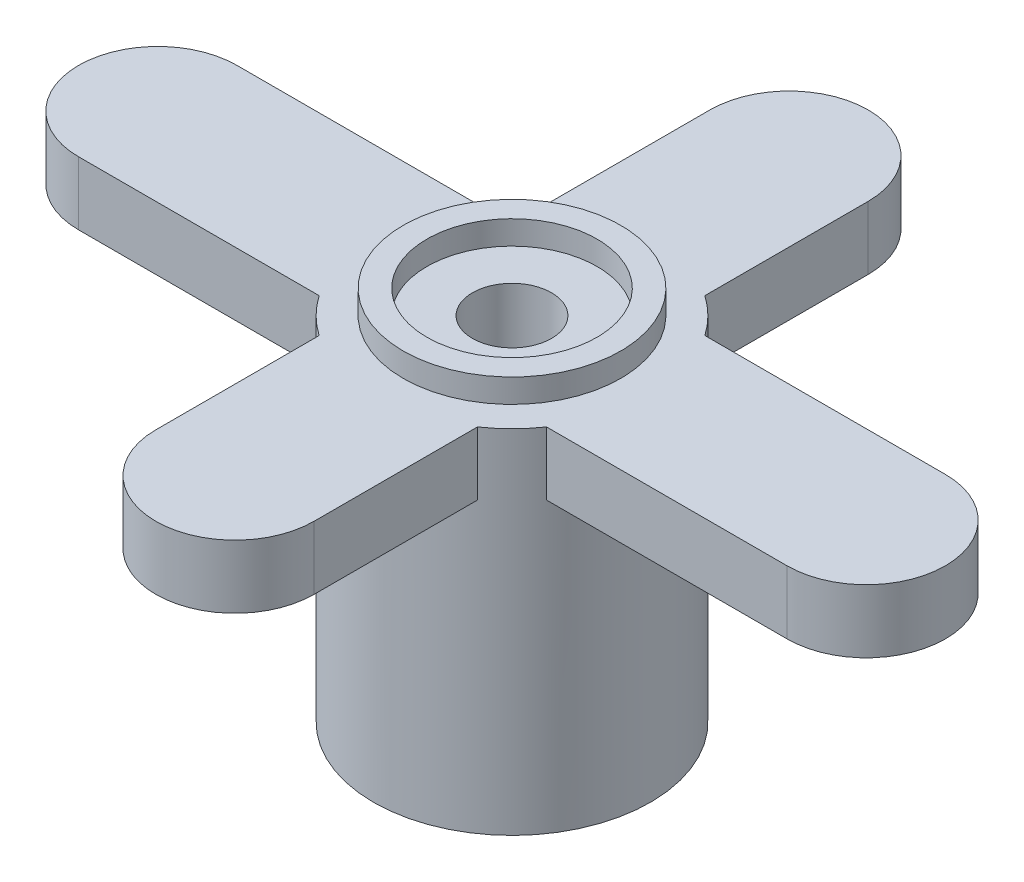
ISO-10303-21;
HEADER;
FILE_DESCRIPTION(('STEP AP214'),'2;1');
FILE_NAME('part.step','',(''),(''),'','','');
FILE_SCHEMA(('AUTOMOTIVE_DESIGN { 1 0 10303 214 1 1 1 1 }'));
ENDSEC;
DATA;
#1=APPLICATION_CONTEXT('core data for automotive mechanical design processes');
#2=APPLICATION_PROTOCOL_DEFINITION('international standard','automotive_design',2000,#1);
#3=PRODUCT_CONTEXT('',#1,'mechanical');
#4=PRODUCT('Part','Part','',(#3));
#5=PRODUCT_RELATED_PRODUCT_CATEGORY('part','',(#4));
#6=PRODUCT_DEFINITION_FORMATION('','',#4);
#7=PRODUCT_DEFINITION_CONTEXT('part definition',#1,'design');
#8=PRODUCT_DEFINITION('design','',#6,#7);
#9=PRODUCT_DEFINITION_SHAPE('','',#8);
#10=(LENGTH_UNIT() NAMED_UNIT(*) SI_UNIT(.MILLI.,.METRE.));
#11=(NAMED_UNIT(*) PLANE_ANGLE_UNIT() SI_UNIT($,.RADIAN.));
#12=(NAMED_UNIT(*) SI_UNIT($,.STERADIAN.) SOLID_ANGLE_UNIT());
#13=UNCERTAINTY_MEASURE_WITH_UNIT(LENGTH_MEASURE(1.E-05),#10,'distance_accuracy_value','');
#14=(GEOMETRIC_REPRESENTATION_CONTEXT(3) GLOBAL_UNCERTAINTY_ASSIGNED_CONTEXT((#13)) GLOBAL_UNIT_ASSIGNED_CONTEXT((#10,
#11,#12)) REPRESENTATION_CONTEXT('',''));
#15=CARTESIAN_POINT('',(0.,0.,0.));
#16=DIRECTION('',(0.,0.,1.));
#17=DIRECTION('',(1.,0.,0.));
#18=AXIS2_PLACEMENT_3D('',#15,#16,#17);
#19=CARTESIAN_POINT('',(0.,9.5,0.));
#20=DIRECTION('',(0.,-1.,0.));
#21=DIRECTION('',(0.,0.,-1.));
#22=AXIS2_PLACEMENT_3D('',#19,#20,#21);
#23=CYLINDRICAL_SURFACE('',#22,3.5);
#24=CARTESIAN_POINT('',(0.,0.,0.));
#25=DIRECTION('',(0.,1.,0.));
#26=DIRECTION('',(0.,0.,1.));
#27=AXIS2_PLACEMENT_3D('',#24,#25,#26);
#28=CIRCLE('',#27,3.5);
#29=CARTESIAN_POINT('',(0.,0.,3.5));
#30=VERTEX_POINT('',#29);
#31=EDGE_CURVE('E171',#30,#30,#28,.T.);
#32=ORIENTED_EDGE('',*,*,#31,.T.);
#33=EDGE_LOOP('',(#32));
#34=FACE_BOUND('',#33,.T.);
#35=CARTESIAN_POINT('',(0.,8.9,0.));
#36=DIRECTION('',(0.,1.,0.));
#37=DIRECTION('',(0.,0.,1.));
#38=AXIS2_PLACEMENT_3D('',#35,#36,#37);
#39=CIRCLE('',#38,3.5);
#40=CARTESIAN_POINT('',(2.87228132326901,8.9,2.));
#41=VERTEX_POINT('',#40);
#42=CARTESIAN_POINT('',(2.,8.9,2.87228132326901));
#43=VERTEX_POINT('',#42);
#44=EDGE_CURVE('E157',#41,#43,#39,.F.);
#45=ORIENTED_EDGE('',*,*,#44,.T.);
#46=DIRECTION('',(0.,-1.,0.));
#47=VECTOR('',#46,1.);
#48=CARTESIAN_POINT('',(2.,9.5,2.87228132326901));
#49=LINE('',#48,#47);
#50=CARTESIAN_POINT('',(2.,7.3,2.87228132326901));
#51=VERTEX_POINT('',#50);
#52=EDGE_CURVE('E196',#43,#51,#49,.T.);
#53=ORIENTED_EDGE('',*,*,#52,.T.);
#54=CARTESIAN_POINT('',(0.,7.3,0.));
#55=DIRECTION('',(0.,1.,0.));
#56=DIRECTION('',(0.,0.,1.));
#57=AXIS2_PLACEMENT_3D('',#54,#55,#56);
#58=CIRCLE('',#57,3.5);
#59=CARTESIAN_POINT('',(-2.,7.3,2.87228132326901));
#60=VERTEX_POINT('',#59);
#61=EDGE_CURVE('E11',#60,#51,#58,.T.);
#62=ORIENTED_EDGE('',*,*,#61,.F.);
#63=DIRECTION('',(0.,-1.,0.));
#64=VECTOR('',#63,1.);
#65=CARTESIAN_POINT('',(-2.,9.5,2.87228132326901));
#66=LINE('',#65,#64);
#67=CARTESIAN_POINT('',(-2.,8.9,2.87228132326901));
#68=VERTEX_POINT('',#67);
#69=EDGE_CURVE('E39',#68,#60,#66,.T.);
#70=ORIENTED_EDGE('',*,*,#69,.F.);
#71=CARTESIAN_POINT('',(-2.87228132326901,8.9,2.));
#72=VERTEX_POINT('',#71);
#73=EDGE_CURVE('E146',#68,#72,#39,.F.);
#74=ORIENTED_EDGE('',*,*,#73,.T.);
#75=DIRECTION('',(0.,-1.,0.));
#76=VECTOR('',#75,1.);
#77=CARTESIAN_POINT('',(-2.87228132326901,9.5,2.));
#78=LINE('',#77,#76);
#79=CARTESIAN_POINT('',(-2.87228132326901,7.3,2.));
#80=VERTEX_POINT('',#79);
#81=EDGE_CURVE('E149',#72,#80,#78,.T.);
#82=ORIENTED_EDGE('',*,*,#81,.T.);
#83=CARTESIAN_POINT('',(0.,7.3,0.));
#84=DIRECTION('',(0.,1.,0.));
#85=DIRECTION('',(0.,0.,1.));
#86=AXIS2_PLACEMENT_3D('',#83,#84,#85);
#87=CIRCLE('',#86,3.5);
#88=CARTESIAN_POINT('',(-2.87228132326901,7.3,-2.));
#89=VERTEX_POINT('',#88);
#90=EDGE_CURVE('E46',#89,#80,#87,.T.);
#91=ORIENTED_EDGE('',*,*,#90,.F.);
#92=DIRECTION('',(0.,-1.,0.));
#93=VECTOR('',#92,1.);
#94=CARTESIAN_POINT('',(-2.87228132326901,9.5,-2.));
#95=LINE('',#94,#93);
#96=CARTESIAN_POINT('',(-2.87228132326901,8.9,-2.));
#97=VERTEX_POINT('',#96);
#98=EDGE_CURVE('E54',#97,#89,#95,.T.);
#99=ORIENTED_EDGE('',*,*,#98,.F.);
#100=CARTESIAN_POINT('',(-2.,8.9,-2.87228132326901));
#101=VERTEX_POINT('',#100);
#102=EDGE_CURVE('E155',#97,#101,#39,.F.);
#103=ORIENTED_EDGE('',*,*,#102,.T.);
#104=DIRECTION('',(0.,-1.,0.));
#105=VECTOR('',#104,1.);
#106=CARTESIAN_POINT('',(-2.,9.5,-2.87228132326901));
#107=LINE('',#106,#105);
#108=CARTESIAN_POINT('',(-2.,7.3,-2.87228132326901));
#109=VERTEX_POINT('',#108);
#110=EDGE_CURVE('E180',#109,#101,#107,.F.);
#111=ORIENTED_EDGE('',*,*,#110,.F.);
#112=CARTESIAN_POINT('',(0.,7.3,0.));
#113=DIRECTION('',(0.,1.,0.));
#114=DIRECTION('',(0.,0.,1.));
#115=AXIS2_PLACEMENT_3D('',#112,#113,#114);
#116=CIRCLE('',#115,3.5);
#117=CARTESIAN_POINT('',(2.,7.3,-2.87228132326901));
#118=VERTEX_POINT('',#117);
#119=EDGE_CURVE('E186',#118,#109,#116,.T.);
#120=ORIENTED_EDGE('',*,*,#119,.F.);
#121=DIRECTION('',(0.,-1.,0.));
#122=VECTOR('',#121,1.);
#123=CARTESIAN_POINT('',(2.,9.5,-2.87228132326901));
#124=LINE('',#123,#122);
#125=CARTESIAN_POINT('',(2.,8.9,-2.87228132326901));
#126=VERTEX_POINT('',#125);
#127=EDGE_CURVE('E183',#118,#126,#124,.F.);
#128=ORIENTED_EDGE('',*,*,#127,.T.);
#129=CARTESIAN_POINT('',(2.87228132326901,8.9,-2.));
#130=VERTEX_POINT('',#129);
#131=EDGE_CURVE('E395',#126,#130,#39,.F.);
#132=ORIENTED_EDGE('',*,*,#131,.T.);
#133=DIRECTION('',(0.,-1.,0.));
#134=VECTOR('',#133,1.);
#135=CARTESIAN_POINT('',(2.87228132326901,9.5,-2.));
#136=LINE('',#135,#134);
#137=CARTESIAN_POINT('',(2.87228132326901,7.3,-2.));
#138=VERTEX_POINT('',#137);
#139=EDGE_CURVE('E188',#138,#130,#136,.F.);
#140=ORIENTED_EDGE('',*,*,#139,.F.);
#141=CARTESIAN_POINT('',(0.,7.3,0.));
#142=DIRECTION('',(0.,1.,0.));
#143=DIRECTION('',(0.,0.,1.));
#144=AXIS2_PLACEMENT_3D('',#141,#142,#143);
#145=CIRCLE('',#144,3.5);
#146=CARTESIAN_POINT('',(2.87228132326901,7.3,2.));
#147=VERTEX_POINT('',#146);
#148=EDGE_CURVE('E194',#147,#138,#145,.T.);
#149=ORIENTED_EDGE('',*,*,#148,.F.);
#150=DIRECTION('',(0.,-1.,0.));
#151=VECTOR('',#150,1.);
#152=CARTESIAN_POINT('',(2.87228132326901,9.5,2.));
#153=LINE('',#152,#151);
#154=EDGE_CURVE('E191',#147,#41,#153,.F.);
#155=ORIENTED_EDGE('',*,*,#154,.T.);
#156=EDGE_LOOP('',(#45,#53,#62,#70,#74,#82,#91,#99,#103,#111,#120,#128,#132,#140,#149,#155));
#157=FACE_BOUND('',#156,.T.);
#158=ADVANCED_FACE('F32',(#34,#157),#23,.T.);
#159=CARTESIAN_POINT('',(0.,9.5,0.));
#160=DIRECTION('',(0.,1.,0.));
#161=DIRECTION('',(0.,0.,1.));
#162=AXIS2_PLACEMENT_3D('',#159,#160,#161);
#163=PLANE('',#162);
#164=CARTESIAN_POINT('',(0.,9.5,0.));
#165=DIRECTION('',(0.,1.,0.));
#166=DIRECTION('',(0.,0.,1.));
#167=AXIS2_PLACEMENT_3D('',#164,#165,#166);
#168=CIRCLE('',#167,2.15);
#169=CARTESIAN_POINT('',(0.,9.5,2.15));
#170=VERTEX_POINT('',#169);
#171=EDGE_CURVE('E404',#170,#170,#168,.T.);
#172=ORIENTED_EDGE('',*,*,#171,.F.);
#173=EDGE_LOOP('',(#172));
#174=FACE_BOUND('',#173,.T.);
#175=CARTESIAN_POINT('',(0.,9.5,0.));
#176=DIRECTION('',(0.,1.,0.));
#177=DIRECTION('',(0.,0.,1.));
#178=AXIS2_PLACEMENT_3D('',#175,#176,#177);
#179=CIRCLE('',#178,2.75);
#180=CARTESIAN_POINT('',(0.,9.5,2.75));
#181=VERTEX_POINT('',#180);
#182=EDGE_CURVE('E393',#181,#181,#179,.T.);
#183=ORIENTED_EDGE('',*,*,#182,.T.);
#184=EDGE_LOOP('',(#183));
#185=FACE_BOUND('',#184,.T.);
#186=ADVANCED_FACE('F294',(#174,#185),#163,.T.);
#187=CARTESIAN_POINT('',(0.,0.,0.));
#188=DIRECTION('',(0.,1.,0.));
#189=DIRECTION('',(0.,0.,1.));
#190=AXIS2_PLACEMENT_3D('',#187,#188,#189);
#191=PLANE('',#190);
#192=CARTESIAN_POINT('',(0.,0.,0.));
#193=DIRECTION('',(0.,-1.,0.));
#194=DIRECTION('',(0.,0.,-1.));
#195=AXIS2_PLACEMENT_3D('',#192,#193,#194);
#196=CIRCLE('',#195,1.9);
#197=CARTESIAN_POINT('',(0.,0.,-1.9));
#198=VERTEX_POINT('',#197);
#199=EDGE_CURVE('E283',#198,#198,#196,.T.);
#200=ORIENTED_EDGE('',*,*,#199,.F.);
#201=EDGE_LOOP('',(#200));
#202=FACE_BOUND('',#201,.T.);
#203=ORIENTED_EDGE('',*,*,#31,.F.);
#204=EDGE_LOOP('',(#203));
#205=FACE_BOUND('',#204,.T.);
#206=ADVANCED_FACE('F291',(#202,#205),#191,.F.);
#207=CARTESIAN_POINT('',(0.,3.5,0.));
#208=DIRECTION('',(0.,-1.,0.));
#209=DIRECTION('',(0.,0.,-1.));
#210=AXIS2_PLACEMENT_3D('',#207,#208,#209);
#211=CYLINDRICAL_SURFACE('',#210,1.9);
#212=CARTESIAN_POINT('',(0.,3.5,0.));
#213=DIRECTION('',(0.,-1.,0.));
#214=DIRECTION('',(0.,0.,-1.));
#215=AXIS2_PLACEMENT_3D('',#212,#213,#214);
#216=CIRCLE('',#215,1.9);
#217=CARTESIAN_POINT('',(0.,3.5,-1.9));
#218=VERTEX_POINT('',#217);
#219=EDGE_CURVE('E175',#218,#218,#216,.T.);
#220=ORIENTED_EDGE('',*,*,#219,.F.);
#221=EDGE_LOOP('',(#220));
#222=FACE_BOUND('',#221,.T.);
#223=ORIENTED_EDGE('',*,*,#199,.T.);
#224=EDGE_LOOP('',(#223));
#225=FACE_BOUND('',#224,.T.);
#226=ADVANCED_FACE('F289',(#222,#225),#211,.F.);
#227=CARTESIAN_POINT('',(0.,3.5,0.));
#228=DIRECTION('',(0.,-1.,0.));
#229=DIRECTION('',(0.,0.,-1.));
#230=AXIS2_PLACEMENT_3D('',#227,#228,#229);
#231=PLANE('',#230);
#232=CARTESIAN_POINT('',(0.,3.5,0.));
#233=DIRECTION('',(0.,-1.,0.));
#234=DIRECTION('',(0.,0.,-1.));
#235=AXIS2_PLACEMENT_3D('',#232,#233,#234);
#236=CIRCLE('',#235,1.);
#237=CARTESIAN_POINT('',(0.,3.5,-1.));
#238=VERTEX_POINT('',#237);
#239=EDGE_CURVE('E401',#238,#238,#236,.T.);
#240=ORIENTED_EDGE('',*,*,#239,.F.);
#241=EDGE_LOOP('',(#240));
#242=FACE_BOUND('',#241,.T.);
#243=ORIENTED_EDGE('',*,*,#219,.T.);
#244=EDGE_LOOP('',(#243));
#245=FACE_BOUND('',#244,.T.);
#246=ADVANCED_FACE('F310',(#242,#245),#231,.T.);
#247=CARTESIAN_POINT('',(0.,7.3,-2.));
#248=DIRECTION('',(0.,0.,1.));
#249=DIRECTION('',(1.,0.,0.));
#250=AXIS2_PLACEMENT_3D('',#247,#248,#249);
#251=PLANE('',#250);
#252=DIRECTION('',(1.,0.,0.));
#253=VECTOR('',#252,1.);
#254=CARTESIAN_POINT('',(0.,8.9,-2.));
#255=LINE('',#254,#253);
#256=CARTESIAN_POINT('',(-8.95,8.9,-2.));
#257=VERTEX_POINT('',#256);
#258=EDGE_CURVE('E167',#257,#97,#255,.T.);
#259=ORIENTED_EDGE('',*,*,#258,.T.);
#260=ORIENTED_EDGE('',*,*,#98,.T.);
#261=DIRECTION('',(1.,0.,0.));
#262=VECTOR('',#261,1.);
#263=CARTESIAN_POINT('',(0.,7.3,-2.));
#264=LINE('',#263,#262);
#265=CARTESIAN_POINT('',(-8.95,7.3,-2.));
#266=VERTEX_POINT('',#265);
#267=EDGE_CURVE('E276',#266,#89,#264,.T.);
#268=ORIENTED_EDGE('',*,*,#267,.F.);
#269=DIRECTION('',(0.,1.,0.));
#270=VECTOR('',#269,1.);
#271=CARTESIAN_POINT('',(-8.95,7.3,-2.));
#272=LINE('',#271,#270);
#273=EDGE_CURVE('E281',#266,#257,#272,.T.);
#274=ORIENTED_EDGE('',*,*,#273,.T.);
#275=EDGE_LOOP('',(#259,#260,#268,#274));
#276=FACE_BOUND('',#275,.T.);
#277=ADVANCED_FACE('F314',(#276),#251,.F.);
#278=CARTESIAN_POINT('',(0.,7.3,2.));
#279=DIRECTION('',(0.,0.,1.));
#280=DIRECTION('',(1.,0.,0.));
#281=AXIS2_PLACEMENT_3D('',#278,#279,#280);
#282=PLANE('',#281);
#283=ORIENTED_EDGE('',*,*,#81,.F.);
#284=DIRECTION('',(1.,0.,0.));
#285=VECTOR('',#284,1.);
#286=CARTESIAN_POINT('',(0.,8.9,2.));
#287=LINE('',#286,#285);
#288=CARTESIAN_POINT('',(-8.95,8.9,2.));
#289=VERTEX_POINT('',#288);
#290=EDGE_CURVE('E160',#289,#72,#287,.T.);
#291=ORIENTED_EDGE('',*,*,#290,.F.);
#292=DIRECTION('',(0.,1.,0.));
#293=VECTOR('',#292,1.);
#294=CARTESIAN_POINT('',(-8.95,7.3,2.));
#295=LINE('',#294,#293);
#296=CARTESIAN_POINT('',(-8.95,7.3,2.));
#297=VERTEX_POINT('',#296);
#298=EDGE_CURVE('E278',#297,#289,#295,.T.);
#299=ORIENTED_EDGE('',*,*,#298,.F.);
#300=DIRECTION('',(1.,0.,0.));
#301=VECTOR('',#300,1.);
#302=CARTESIAN_POINT('',(0.,7.3,2.));
#303=LINE('',#302,#301);
#304=EDGE_CURVE('E170',#297,#80,#303,.T.);
#305=ORIENTED_EDGE('',*,*,#304,.T.);
#306=EDGE_LOOP('',(#283,#291,#299,#305));
#307=FACE_BOUND('',#306,.T.);
#308=ADVANCED_FACE('F169',(#307),#282,.T.);
#309=CARTESIAN_POINT('',(-8.95,7.3,0.));
#310=DIRECTION('',(0.,1.,0.));
#311=DIRECTION('',(0.,0.,1.));
#312=AXIS2_PLACEMENT_3D('',#309,#310,#311);
#313=CYLINDRICAL_SURFACE('',#312,2.);
#314=CARTESIAN_POINT('',(-8.95,8.9,0.));
#315=DIRECTION('',(0.,1.,0.));
#316=DIRECTION('',(0.,0.,1.));
#317=AXIS2_PLACEMENT_3D('',#314,#315,#316);
#318=CIRCLE('',#317,2.);
#319=EDGE_CURVE('E165',#257,#289,#318,.T.);
#320=ORIENTED_EDGE('',*,*,#319,.F.);
#321=ORIENTED_EDGE('',*,*,#273,.F.);
#322=CARTESIAN_POINT('',(-8.95,7.3,0.));
#323=DIRECTION('',(0.,1.,0.));
#324=DIRECTION('',(0.,0.,1.));
#325=AXIS2_PLACEMENT_3D('',#322,#323,#324);
#326=CIRCLE('',#325,2.);
#327=EDGE_CURVE('E272',#266,#297,#326,.T.);
#328=ORIENTED_EDGE('',*,*,#327,.T.);
#329=ORIENTED_EDGE('',*,*,#298,.T.);
#330=EDGE_LOOP('',(#320,#321,#328,#329));
#331=FACE_BOUND('',#330,.T.);
#332=ADVANCED_FACE('F316',(#331),#313,.T.);
#333=CARTESIAN_POINT('',(0.,7.3,0.));
#334=DIRECTION('',(0.,1.,0.));
#335=DIRECTION('',(0.,0.,1.));
#336=AXIS2_PLACEMENT_3D('',#333,#334,#335);
#337=PLANE('',#336);
#338=ORIENTED_EDGE('',*,*,#267,.T.);
#339=ORIENTED_EDGE('',*,*,#90,.T.);
#340=ORIENTED_EDGE('',*,*,#304,.F.);
#341=ORIENTED_EDGE('',*,*,#327,.F.);
#342=EDGE_LOOP('',(#338,#339,#340,#341));
#343=FACE_BOUND('',#342,.T.);
#344=ADVANCED_FACE('F319',(#343),#337,.F.);
#345=CARTESIAN_POINT('',(0.,8.9,0.));
#346=DIRECTION('',(0.,1.,0.));
#347=DIRECTION('',(0.,0.,1.));
#348=AXIS2_PLACEMENT_3D('',#345,#346,#347);
#349=PLANE('',#348);
#350=ORIENTED_EDGE('',*,*,#290,.T.);
#351=ORIENTED_EDGE('',*,*,#73,.F.);
#352=DIRECTION('',(0.,0.,-1.));
#353=VECTOR('',#352,1.);
#354=CARTESIAN_POINT('',(-2.,8.9,0.));
#355=LINE('',#354,#353);
#356=CARTESIAN_POINT('',(-2.,8.9,7.));
#357=VERTEX_POINT('',#356);
#358=EDGE_CURVE('E204',#357,#68,#355,.T.);
#359=ORIENTED_EDGE('',*,*,#358,.F.);
#360=CARTESIAN_POINT('',(0.,8.9,7.));
#361=DIRECTION('',(0.,1.,0.));
#362=DIRECTION('',(0.,0.,1.));
#363=AXIS2_PLACEMENT_3D('',#360,#361,#362);
#364=CIRCLE('',#363,2.);
#365=CARTESIAN_POINT('',(2.,8.9,7.));
#366=VERTEX_POINT('',#365);
#367=EDGE_CURVE('E211',#357,#366,#364,.T.);
#368=ORIENTED_EDGE('',*,*,#367,.T.);
#369=DIRECTION('',(0.,0.,-1.));
#370=VECTOR('',#369,1.);
#371=CARTESIAN_POINT('',(2.,8.9,0.));
#372=LINE('',#371,#370);
#373=EDGE_CURVE('E219',#366,#43,#372,.T.);
#374=ORIENTED_EDGE('',*,*,#373,.T.);
#375=ORIENTED_EDGE('',*,*,#44,.F.);
#376=DIRECTION('',(1.,0.,0.));
#377=VECTOR('',#376,1.);
#378=CARTESIAN_POINT('',(0.,8.9,2.));
#379=LINE('',#378,#377);
#380=CARTESIAN_POINT('',(8.95,8.9,2.));
#381=VERTEX_POINT('',#380);
#382=EDGE_CURVE('E247',#41,#381,#379,.T.);
#383=ORIENTED_EDGE('',*,*,#382,.T.);
#384=CARTESIAN_POINT('',(8.95,8.9,0.));
#385=DIRECTION('',(0.,1.,0.));
#386=DIRECTION('',(0.,0.,1.));
#387=AXIS2_PLACEMENT_3D('',#384,#385,#386);
#388=CIRCLE('',#387,2.);
#389=CARTESIAN_POINT('',(8.95,8.9,-2.));
#390=VERTEX_POINT('',#389);
#391=EDGE_CURVE('E243',#381,#390,#388,.T.);
#392=ORIENTED_EDGE('',*,*,#391,.T.);
#393=DIRECTION('',(1.,0.,0.));
#394=VECTOR('',#393,1.);
#395=CARTESIAN_POINT('',(0.,8.9,-2.));
#396=LINE('',#395,#394);
#397=EDGE_CURVE('E236',#130,#390,#396,.T.);
#398=ORIENTED_EDGE('',*,*,#397,.F.);
#399=ORIENTED_EDGE('',*,*,#131,.F.);
#400=DIRECTION('',(0.,0.,-1.));
#401=VECTOR('',#400,1.);
#402=CARTESIAN_POINT('',(2.,8.9,0.));
#403=LINE('',#402,#401);
#404=CARTESIAN_POINT('',(2.,8.9,-7.));
#405=VERTEX_POINT('',#404);
#406=EDGE_CURVE('E266',#126,#405,#403,.T.);
#407=ORIENTED_EDGE('',*,*,#406,.T.);
#408=CARTESIAN_POINT('',(0.,8.9,-7.));
#409=DIRECTION('',(0.,1.,0.));
#410=DIRECTION('',(0.,0.,1.));
#411=AXIS2_PLACEMENT_3D('',#408,#409,#410);
#412=CIRCLE('',#411,2.);
#413=CARTESIAN_POINT('',(-2.,8.9,-7.));
#414=VERTEX_POINT('',#413);
#415=EDGE_CURVE('E263',#405,#414,#412,.T.);
#416=ORIENTED_EDGE('',*,*,#415,.T.);
#417=DIRECTION('',(0.,0.,-1.));
#418=VECTOR('',#417,1.);
#419=CARTESIAN_POINT('',(-2.,8.9,0.));
#420=LINE('',#419,#418);
#421=EDGE_CURVE('E256',#101,#414,#420,.T.);
#422=ORIENTED_EDGE('',*,*,#421,.F.);
#423=ORIENTED_EDGE('',*,*,#102,.F.);
#424=ORIENTED_EDGE('',*,*,#258,.F.);
#425=ORIENTED_EDGE('',*,*,#319,.T.);
#426=EDGE_LOOP('',(#350,#351,#359,#368,#374,#375,#383,#392,#398,#399,#407,#416,#422,#423,#424,#425));
#427=FACE_BOUND('',#426,.T.);
#428=CARTESIAN_POINT('',(0.,8.9,0.));
#429=DIRECTION('',(0.,1.,0.));
#430=DIRECTION('',(0.,0.,1.));
#431=AXIS2_PLACEMENT_3D('',#428,#429,#430);
#432=CIRCLE('',#431,2.75);
#433=CARTESIAN_POINT('',(0.,8.9,2.75));
#434=VERTEX_POINT('',#433);
#435=EDGE_CURVE('E154',#434,#434,#432,.F.);
#436=ORIENTED_EDGE('',*,*,#435,.T.);
#437=EDGE_LOOP('',(#436));
#438=FACE_BOUND('',#437,.T.);
#439=ADVANCED_FACE('F161',(#427,#438),#349,.T.);
#440=CARTESIAN_POINT('',(2.,7.3,0.));
#441=DIRECTION('',(1.,0.,0.));
#442=DIRECTION('',(0.,0.,-1.));
#443=AXIS2_PLACEMENT_3D('',#440,#441,#442);
#444=PLANE('',#443);
#445=ORIENTED_EDGE('',*,*,#127,.F.);
#446=DIRECTION('',(0.,0.,-1.));
#447=VECTOR('',#446,1.);
#448=CARTESIAN_POINT('',(2.,7.3,0.));
#449=LINE('',#448,#447);
#450=CARTESIAN_POINT('',(2.,7.3,-7.));
#451=VERTEX_POINT('',#450);
#452=EDGE_CURVE('E246',#118,#451,#449,.T.);
#453=ORIENTED_EDGE('',*,*,#452,.T.);
#454=DIRECTION('',(0.,1.,0.));
#455=VECTOR('',#454,1.);
#456=CARTESIAN_POINT('',(2.,7.3,-7.));
#457=LINE('',#456,#455);
#458=EDGE_CURVE('E253',#451,#405,#457,.T.);
#459=ORIENTED_EDGE('',*,*,#458,.T.);
#460=ORIENTED_EDGE('',*,*,#406,.F.);
#461=EDGE_LOOP('',(#445,#453,#459,#460));
#462=FACE_BOUND('',#461,.T.);
#463=ADVANCED_FACE('F327',(#462),#444,.T.);
#464=CARTESIAN_POINT('',(-2.,7.3,0.));
#465=DIRECTION('',(1.,0.,0.));
#466=DIRECTION('',(0.,0.,-1.));
#467=AXIS2_PLACEMENT_3D('',#464,#465,#466);
#468=PLANE('',#467);
#469=DIRECTION('',(0.,0.,-1.));
#470=VECTOR('',#469,1.);
#471=CARTESIAN_POINT('',(-2.,7.3,0.));
#472=LINE('',#471,#470);
#473=CARTESIAN_POINT('',(-2.,7.3,-7.));
#474=VERTEX_POINT('',#473);
#475=EDGE_CURVE('E260',#109,#474,#472,.T.);
#476=ORIENTED_EDGE('',*,*,#475,.F.);
#477=ORIENTED_EDGE('',*,*,#110,.T.);
#478=ORIENTED_EDGE('',*,*,#421,.T.);
#479=DIRECTION('',(0.,1.,0.));
#480=VECTOR('',#479,1.);
#481=CARTESIAN_POINT('',(-2.,7.3,-7.));
#482=LINE('',#481,#480);
#483=EDGE_CURVE('E257',#474,#414,#482,.T.);
#484=ORIENTED_EDGE('',*,*,#483,.F.);
#485=EDGE_LOOP('',(#476,#477,#478,#484));
#486=FACE_BOUND('',#485,.T.);
#487=ADVANCED_FACE('F336',(#486),#468,.F.);
#488=CARTESIAN_POINT('',(0.,7.3,-7.));
#489=DIRECTION('',(0.,1.,0.));
#490=DIRECTION('',(0.,0.,1.));
#491=AXIS2_PLACEMENT_3D('',#488,#489,#490);
#492=CYLINDRICAL_SURFACE('',#491,2.);
#493=ORIENTED_EDGE('',*,*,#415,.F.);
#494=ORIENTED_EDGE('',*,*,#458,.F.);
#495=CARTESIAN_POINT('',(0.,7.3,-7.));
#496=DIRECTION('',(0.,1.,0.));
#497=DIRECTION('',(0.,0.,1.));
#498=AXIS2_PLACEMENT_3D('',#495,#496,#497);
#499=CIRCLE('',#498,2.);
#500=EDGE_CURVE('E261',#451,#474,#499,.T.);
#501=ORIENTED_EDGE('',*,*,#500,.T.);
#502=ORIENTED_EDGE('',*,*,#483,.T.);
#503=EDGE_LOOP('',(#493,#494,#501,#502));
#504=FACE_BOUND('',#503,.T.);
#505=ADVANCED_FACE('F334',(#504),#492,.T.);
#506=CARTESIAN_POINT('',(0.,7.3,0.));
#507=DIRECTION('',(0.,1.,0.));
#508=DIRECTION('',(0.,0.,1.));
#509=AXIS2_PLACEMENT_3D('',#506,#507,#508);
#510=PLANE('',#509);
#511=ORIENTED_EDGE('',*,*,#452,.F.);
#512=ORIENTED_EDGE('',*,*,#119,.T.);
#513=ORIENTED_EDGE('',*,*,#475,.T.);
#514=ORIENTED_EDGE('',*,*,#500,.F.);
#515=EDGE_LOOP('',(#511,#512,#513,#514));
#516=FACE_BOUND('',#515,.T.);
#517=ADVANCED_FACE('F330',(#516),#510,.F.);
#518=CARTESIAN_POINT('',(0.,7.3,2.));
#519=DIRECTION('',(0.,0.,1.));
#520=DIRECTION('',(1.,0.,0.));
#521=AXIS2_PLACEMENT_3D('',#518,#519,#520);
#522=PLANE('',#521);
#523=ORIENTED_EDGE('',*,*,#154,.F.);
#524=DIRECTION('',(1.,0.,0.));
#525=VECTOR('',#524,1.);
#526=CARTESIAN_POINT('',(0.,7.3,2.));
#527=LINE('',#526,#525);
#528=CARTESIAN_POINT('',(8.95,7.3,2.));
#529=VERTEX_POINT('',#528);
#530=EDGE_CURVE('E230',#147,#529,#527,.T.);
#531=ORIENTED_EDGE('',*,*,#530,.T.);
#532=DIRECTION('',(0.,1.,0.));
#533=VECTOR('',#532,1.);
#534=CARTESIAN_POINT('',(8.95,7.3,2.));
#535=LINE('',#534,#533);
#536=EDGE_CURVE('E233',#529,#381,#535,.T.);
#537=ORIENTED_EDGE('',*,*,#536,.T.);
#538=ORIENTED_EDGE('',*,*,#382,.F.);
#539=EDGE_LOOP('',(#523,#531,#537,#538));
#540=FACE_BOUND('',#539,.T.);
#541=ADVANCED_FACE('F333',(#540),#522,.T.);
#542=CARTESIAN_POINT('',(0.,7.3,-2.));
#543=DIRECTION('',(0.,0.,1.));
#544=DIRECTION('',(1.,0.,0.));
#545=AXIS2_PLACEMENT_3D('',#542,#543,#544);
#546=PLANE('',#545);
#547=DIRECTION('',(1.,0.,0.));
#548=VECTOR('',#547,1.);
#549=CARTESIAN_POINT('',(0.,7.3,-2.));
#550=LINE('',#549,#548);
#551=CARTESIAN_POINT('',(8.95,7.3,-2.));
#552=VERTEX_POINT('',#551);
#553=EDGE_CURVE('E240',#138,#552,#550,.T.);
#554=ORIENTED_EDGE('',*,*,#553,.F.);
#555=ORIENTED_EDGE('',*,*,#139,.T.);
#556=ORIENTED_EDGE('',*,*,#397,.T.);
#557=DIRECTION('',(0.,1.,0.));
#558=VECTOR('',#557,1.);
#559=CARTESIAN_POINT('',(8.95,7.3,-2.));
#560=LINE('',#559,#558);
#561=EDGE_CURVE('E237',#552,#390,#560,.T.);
#562=ORIENTED_EDGE('',*,*,#561,.F.);
#563=EDGE_LOOP('',(#554,#555,#556,#562));
#564=FACE_BOUND('',#563,.T.);
#565=ADVANCED_FACE('F351',(#564),#546,.F.);
#566=CARTESIAN_POINT('',(8.95,7.3,0.));
#567=DIRECTION('',(0.,1.,0.));
#568=DIRECTION('',(0.,0.,1.));
#569=AXIS2_PLACEMENT_3D('',#566,#567,#568);
#570=CYLINDRICAL_SURFACE('',#569,2.);
#571=ORIENTED_EDGE('',*,*,#391,.F.);
#572=ORIENTED_EDGE('',*,*,#536,.F.);
#573=CARTESIAN_POINT('',(8.95,7.3,0.));
#574=DIRECTION('',(0.,1.,0.));
#575=DIRECTION('',(0.,0.,1.));
#576=AXIS2_PLACEMENT_3D('',#573,#574,#575);
#577=CIRCLE('',#576,2.);
#578=EDGE_CURVE('E241',#529,#552,#577,.T.);
#579=ORIENTED_EDGE('',*,*,#578,.T.);
#580=ORIENTED_EDGE('',*,*,#561,.T.);
#581=EDGE_LOOP('',(#571,#572,#579,#580));
#582=FACE_BOUND('',#581,.T.);
#583=ADVANCED_FACE('F349',(#582),#570,.T.);
#584=CARTESIAN_POINT('',(0.,7.3,0.));
#585=DIRECTION('',(0.,1.,0.));
#586=DIRECTION('',(0.,0.,1.));
#587=AXIS2_PLACEMENT_3D('',#584,#585,#586);
#588=PLANE('',#587);
#589=ORIENTED_EDGE('',*,*,#530,.F.);
#590=ORIENTED_EDGE('',*,*,#148,.T.);
#591=ORIENTED_EDGE('',*,*,#553,.T.);
#592=ORIENTED_EDGE('',*,*,#578,.F.);
#593=EDGE_LOOP('',(#589,#590,#591,#592));
#594=FACE_BOUND('',#593,.T.);
#595=ADVANCED_FACE('F346',(#594),#588,.F.);
#596=CARTESIAN_POINT('',(-2.,7.3,0.));
#597=DIRECTION('',(1.,0.,0.));
#598=DIRECTION('',(0.,0.,-1.));
#599=AXIS2_PLACEMENT_3D('',#596,#597,#598);
#600=PLANE('',#599);
#601=ORIENTED_EDGE('',*,*,#358,.T.);
#602=ORIENTED_EDGE('',*,*,#69,.T.);
#603=DIRECTION('',(0.,0.,-1.));
#604=VECTOR('',#603,1.);
#605=CARTESIAN_POINT('',(-2.,7.3,0.));
#606=LINE('',#605,#604);
#607=CARTESIAN_POINT('',(-2.,7.3,7.));
#608=VERTEX_POINT('',#607);
#609=EDGE_CURVE('E202',#608,#60,#606,.T.);
#610=ORIENTED_EDGE('',*,*,#609,.F.);
#611=DIRECTION('',(0.,1.,0.));
#612=VECTOR('',#611,1.);
#613=CARTESIAN_POINT('',(-2.,7.3,7.));
#614=LINE('',#613,#612);
#615=EDGE_CURVE('E222',#608,#357,#614,.T.);
#616=ORIENTED_EDGE('',*,*,#615,.T.);
#617=EDGE_LOOP('',(#601,#602,#610,#616));
#618=FACE_BOUND('',#617,.T.);
#619=ADVANCED_FACE('F201',(#618),#600,.F.);
#620=CARTESIAN_POINT('',(2.,7.3,0.));
#621=DIRECTION('',(1.,0.,0.));
#622=DIRECTION('',(0.,0.,-1.));
#623=AXIS2_PLACEMENT_3D('',#620,#621,#622);
#624=PLANE('',#623);
#625=ORIENTED_EDGE('',*,*,#52,.F.);
#626=ORIENTED_EDGE('',*,*,#373,.F.);
#627=DIRECTION('',(0.,1.,0.));
#628=VECTOR('',#627,1.);
#629=CARTESIAN_POINT('',(2.,7.3,7.));
#630=LINE('',#629,#628);
#631=CARTESIAN_POINT('',(2.,7.3,7.));
#632=VERTEX_POINT('',#631);
#633=EDGE_CURVE('E221',#632,#366,#630,.T.);
#634=ORIENTED_EDGE('',*,*,#633,.F.);
#635=DIRECTION('',(0.,0.,-1.));
#636=VECTOR('',#635,1.);
#637=CARTESIAN_POINT('',(2.,7.3,0.));
#638=LINE('',#637,#636);
#639=EDGE_CURVE('E212',#632,#51,#638,.T.);
#640=ORIENTED_EDGE('',*,*,#639,.T.);
#641=EDGE_LOOP('',(#625,#626,#634,#640));
#642=FACE_BOUND('',#641,.T.);
#643=ADVANCED_FACE('F218',(#642),#624,.T.);
#644=CARTESIAN_POINT('',(0.,7.3,7.));
#645=DIRECTION('',(0.,1.,0.));
#646=DIRECTION('',(0.,0.,1.));
#647=AXIS2_PLACEMENT_3D('',#644,#645,#646);
#648=CYLINDRICAL_SURFACE('',#647,2.);
#649=ORIENTED_EDGE('',*,*,#367,.F.);
#650=ORIENTED_EDGE('',*,*,#615,.F.);
#651=CARTESIAN_POINT('',(0.,7.3,7.));
#652=DIRECTION('',(0.,1.,0.));
#653=DIRECTION('',(0.,0.,1.));
#654=AXIS2_PLACEMENT_3D('',#651,#652,#653);
#655=CIRCLE('',#654,2.);
#656=EDGE_CURVE('E210',#608,#632,#655,.T.);
#657=ORIENTED_EDGE('',*,*,#656,.T.);
#658=ORIENTED_EDGE('',*,*,#633,.T.);
#659=EDGE_LOOP('',(#649,#650,#657,#658));
#660=FACE_BOUND('',#659,.T.);
#661=ADVANCED_FACE('F361',(#660),#648,.T.);
#662=CARTESIAN_POINT('',(0.,7.3,0.));
#663=DIRECTION('',(0.,1.,0.));
#664=DIRECTION('',(0.,0.,1.));
#665=AXIS2_PLACEMENT_3D('',#662,#663,#664);
#666=PLANE('',#665);
#667=ORIENTED_EDGE('',*,*,#609,.T.);
#668=ORIENTED_EDGE('',*,*,#61,.T.);
#669=ORIENTED_EDGE('',*,*,#639,.F.);
#670=ORIENTED_EDGE('',*,*,#656,.F.);
#671=EDGE_LOOP('',(#667,#668,#669,#670));
#672=FACE_BOUND('',#671,.T.);
#673=ADVANCED_FACE('F206',(#672),#666,.F.);
#674=CARTESIAN_POINT('',(0.,2.81888168179569,0.));
#675=DIRECTION('',(0.,1.,0.));
#676=DIRECTION('',(0.,0.,1.));
#677=AXIS2_PLACEMENT_3D('',#674,#675,#676);
#678=CYLINDRICAL_SURFACE('',#677,2.15);
#679=CARTESIAN_POINT('',(0.,8.9,0.));
#680=DIRECTION('',(0.,1.,0.));
#681=DIRECTION('',(0.,0.,1.));
#682=AXIS2_PLACEMENT_3D('',#679,#680,#681);
#683=CIRCLE('',#682,2.15);
#684=CARTESIAN_POINT('',(0.,8.9,2.15));
#685=VERTEX_POINT('',#684);
#686=EDGE_CURVE('E406',#685,#685,#683,.F.);
#687=ORIENTED_EDGE('',*,*,#686,.T.);
#688=EDGE_LOOP('',(#687));
#689=FACE_BOUND('',#688,.T.);
#690=ORIENTED_EDGE('',*,*,#171,.T.);
#691=EDGE_LOOP('',(#690));
#692=FACE_BOUND('',#691,.T.);
#693=ADVANCED_FACE('F371',(#689,#692),#678,.F.);
#694=CARTESIAN_POINT('',(0.,8.9,0.));
#695=DIRECTION('',(0.,1.,0.));
#696=DIRECTION('',(0.,0.,1.));
#697=AXIS2_PLACEMENT_3D('',#694,#695,#696);
#698=PLANE('',#697);
#699=CARTESIAN_POINT('',(0.,8.9,0.));
#700=DIRECTION('',(0.,1.,0.));
#701=DIRECTION('',(0.,0.,1.));
#702=AXIS2_PLACEMENT_3D('',#699,#700,#701);
#703=CIRCLE('',#702,1.);
#704=CARTESIAN_POINT('',(0.,8.9,1.));
#705=VERTEX_POINT('',#704);
#706=EDGE_CURVE('E398',#705,#705,#703,.T.);
#707=ORIENTED_EDGE('',*,*,#706,.F.);
#708=EDGE_LOOP('',(#707));
#709=FACE_BOUND('',#708,.T.);
#710=ORIENTED_EDGE('',*,*,#686,.F.);
#711=EDGE_LOOP('',(#710));
#712=FACE_BOUND('',#711,.T.);
#713=ADVANCED_FACE('F374',(#709,#712),#698,.T.);
#714=CARTESIAN_POINT('',(0.,-22.7,0.));
#715=DIRECTION('',(0.,1.,0.));
#716=DIRECTION('',(0.,0.,1.));
#717=AXIS2_PLACEMENT_3D('',#714,#715,#716);
#718=CYLINDRICAL_SURFACE('',#717,1.);
#719=ORIENTED_EDGE('',*,*,#239,.T.);
#720=EDGE_LOOP('',(#719));
#721=FACE_BOUND('',#720,.T.);
#722=ORIENTED_EDGE('',*,*,#706,.T.);
#723=EDGE_LOOP('',(#722));
#724=FACE_BOUND('',#723,.T.);
#725=ADVANCED_FACE('F378',(#721,#724),#718,.F.);
#726=CARTESIAN_POINT('',(0.,-0.999494936611667,0.));
#727=DIRECTION('',(0.,1.,0.));
#728=DIRECTION('',(0.,0.,1.));
#729=AXIS2_PLACEMENT_3D('',#726,#727,#728);
#730=CYLINDRICAL_SURFACE('',#729,2.75);
#731=ORIENTED_EDGE('',*,*,#435,.F.);
#732=EDGE_LOOP('',(#731));
#733=FACE_BOUND('',#732,.T.);
#734=ORIENTED_EDGE('',*,*,#182,.F.);
#735=EDGE_LOOP('',(#734));
#736=FACE_BOUND('',#735,.T.);
#737=ADVANCED_FACE('F382',(#733,#736),#730,.T.);
#738=CLOSED_SHELL('',(#158,#186,#206,#226,#246,#277,#308,#332,#344,#439,#463,#487,#505,#517,
#541,#565,#583,#595,#619,#643,#661,#673,#693,#713,#725,#737));
#739=MANIFOLD_SOLID_BREP('B2',#738);
#740=ADVANCED_BREP_SHAPE_REPRESENTATION('',(#18,#739),#14);
#741=SHAPE_DEFINITION_REPRESENTATION(#9,#740);
ENDSEC;
END-ISO-10303-21;
